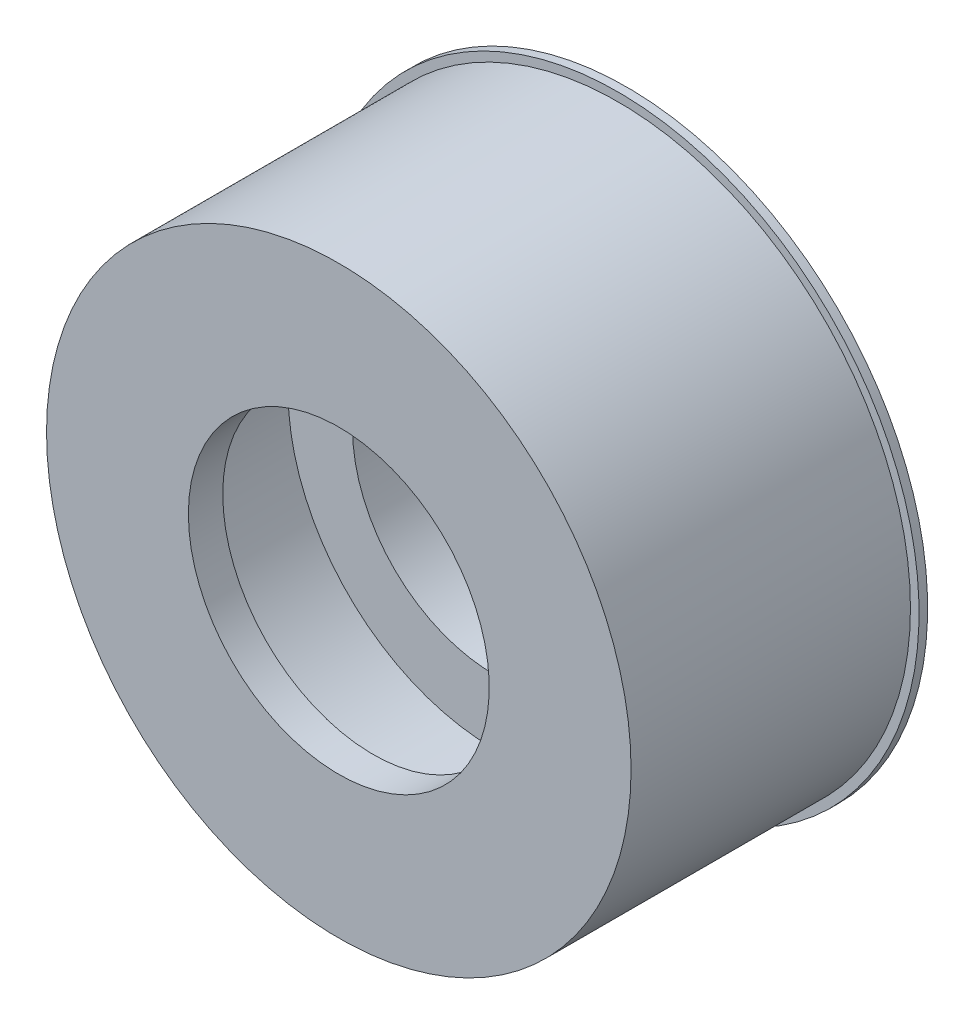
ISO-10303-21;
HEADER;
FILE_DESCRIPTION(('STEP AP214'),'2;1');
FILE_NAME('part.step','',(''),(''),'','','');
FILE_SCHEMA(('AUTOMOTIVE_DESIGN { 1 0 10303 214 1 1 1 1 }'));
ENDSEC;
DATA;
#1=APPLICATION_CONTEXT('core data for automotive mechanical design processes');
#2=APPLICATION_PROTOCOL_DEFINITION('international standard','automotive_design',2000,#1);
#3=PRODUCT_CONTEXT('',#1,'mechanical');
#4=PRODUCT('Part','Part','',(#3));
#5=PRODUCT_RELATED_PRODUCT_CATEGORY('part','',(#4));
#6=PRODUCT_DEFINITION_FORMATION('','',#4);
#7=PRODUCT_DEFINITION_CONTEXT('part definition',#1,'design');
#8=PRODUCT_DEFINITION('design','',#6,#7);
#9=PRODUCT_DEFINITION_SHAPE('','',#8);
#10=(LENGTH_UNIT() NAMED_UNIT(*) SI_UNIT(.MILLI.,.METRE.));
#11=(NAMED_UNIT(*) PLANE_ANGLE_UNIT() SI_UNIT($,.RADIAN.));
#12=(NAMED_UNIT(*) SI_UNIT($,.STERADIAN.) SOLID_ANGLE_UNIT());
#13=UNCERTAINTY_MEASURE_WITH_UNIT(LENGTH_MEASURE(1.E-05),#10,'distance_accuracy_value','');
#14=(GEOMETRIC_REPRESENTATION_CONTEXT(3) GLOBAL_UNCERTAINTY_ASSIGNED_CONTEXT((#13)) GLOBAL_UNIT_ASSIGNED_CONTEXT((#10,
#11,#12)) REPRESENTATION_CONTEXT('',''));
#15=CARTESIAN_POINT('',(0.,0.,0.));
#16=DIRECTION('',(0.,0.,1.));
#17=DIRECTION('',(1.,0.,0.));
#18=AXIS2_PLACEMENT_3D('',#15,#16,#17);
#19=CARTESIAN_POINT('',(-3.5,0.,6.7));
#20=DIRECTION('',(0.,0.,1.));
#21=DIRECTION('',(1.,0.,0.));
#22=AXIS2_PLACEMENT_3D('',#19,#20,#21);
#23=PLANE('',#22);
#24=CARTESIAN_POINT('',(0.,0.,6.7));
#25=DIRECTION('',(0.,0.,-1.));
#26=DIRECTION('',(-1.,0.,0.));
#27=AXIS2_PLACEMENT_3D('',#24,#25,#26);
#28=CIRCLE('',#27,3.5);
#29=CARTESIAN_POINT('',(-3.5,0.,6.7));
#30=VERTEX_POINT('',#29);
#31=EDGE_CURVE('E100',#30,#30,#28,.T.);
#32=ORIENTED_EDGE('',*,*,#31,.T.);
#33=EDGE_LOOP('',(#32));
#34=FACE_BOUND('',#33,.T.);
#35=CARTESIAN_POINT('',(0.,0.,6.7));
#36=DIRECTION('',(0.,0.,-1.));
#37=DIRECTION('',(-1.,0.,0.));
#38=AXIS2_PLACEMENT_3D('',#35,#36,#37);
#39=CIRCLE('',#38,6.8);
#40=CARTESIAN_POINT('',(-6.8,0.,6.7));
#41=VERTEX_POINT('',#40);
#42=EDGE_CURVE('E10',#41,#41,#39,.T.);
#43=ORIENTED_EDGE('',*,*,#42,.F.);
#44=EDGE_LOOP('',(#43));
#45=FACE_BOUND('',#44,.T.);
#46=ADVANCED_FACE('F41',(#34,#45),#23,.T.);
#47=CARTESIAN_POINT('',(0.,0.,0.));
#48=DIRECTION('',(0.,0.,-1.));
#49=DIRECTION('',(-1.,0.,0.));
#50=AXIS2_PLACEMENT_3D('',#47,#48,#49);
#51=CYLINDRICAL_SURFACE('',#50,6.8);
#52=ORIENTED_EDGE('',*,*,#42,.T.);
#53=EDGE_LOOP('',(#52));
#54=FACE_BOUND('',#53,.T.);
#55=CARTESIAN_POINT('',(0.,0.,0.199999999999999));
#56=DIRECTION('',(0.,0.,-1.));
#57=DIRECTION('',(-1.,0.,0.));
#58=AXIS2_PLACEMENT_3D('',#55,#56,#57);
#59=CIRCLE('',#58,6.8);
#60=CARTESIAN_POINT('',(-6.8,0.,0.2));
#61=VERTEX_POINT('',#60);
#62=EDGE_CURVE('E48',#61,#61,#59,.T.);
#63=ORIENTED_EDGE('',*,*,#62,.F.);
#64=EDGE_LOOP('',(#63));
#65=FACE_BOUND('',#64,.T.);
#66=ADVANCED_FACE('F119',(#54,#65),#51,.T.);
#67=CARTESIAN_POINT('',(-7.,0.,0.2));
#68=DIRECTION('',(0.,0.,1.));
#69=DIRECTION('',(1.,0.,0.));
#70=AXIS2_PLACEMENT_3D('',#67,#68,#69);
#71=PLANE('',#70);
#72=ORIENTED_EDGE('',*,*,#62,.T.);
#73=EDGE_LOOP('',(#72));
#74=FACE_BOUND('',#73,.T.);
#75=CARTESIAN_POINT('',(0.,0.,0.199999999999999));
#76=DIRECTION('',(0.,0.,-1.));
#77=DIRECTION('',(-1.,0.,0.));
#78=AXIS2_PLACEMENT_3D('',#75,#76,#77);
#79=CIRCLE('',#78,7.);
#80=CARTESIAN_POINT('',(-7.,0.,0.2));
#81=VERTEX_POINT('',#80);
#82=EDGE_CURVE('E53',#81,#81,#79,.T.);
#83=ORIENTED_EDGE('',*,*,#82,.F.);
#84=EDGE_LOOP('',(#83));
#85=FACE_BOUND('',#84,.T.);
#86=ADVANCED_FACE('F123',(#74,#85),#71,.T.);
#87=CARTESIAN_POINT('',(0.,0.,0.));
#88=DIRECTION('',(0.,0.,-1.));
#89=DIRECTION('',(-1.,0.,0.));
#90=AXIS2_PLACEMENT_3D('',#87,#88,#89);
#91=CYLINDRICAL_SURFACE('',#90,7.);
#92=ORIENTED_EDGE('',*,*,#82,.T.);
#93=EDGE_LOOP('',(#92));
#94=FACE_BOUND('',#93,.T.);
#95=CARTESIAN_POINT('',(0.,0.,0.));
#96=DIRECTION('',(0.,0.,-1.));
#97=DIRECTION('',(-1.,0.,0.));
#98=AXIS2_PLACEMENT_3D('',#95,#96,#97);
#99=CIRCLE('',#98,7.);
#100=CARTESIAN_POINT('',(-7.,0.,0.));
#101=VERTEX_POINT('',#100);
#102=EDGE_CURVE('E58',#101,#101,#99,.T.);
#103=ORIENTED_EDGE('',*,*,#102,.F.);
#104=EDGE_LOOP('',(#103));
#105=FACE_BOUND('',#104,.T.);
#106=ADVANCED_FACE('F127',(#94,#105),#91,.T.);
#107=CARTESIAN_POINT('',(-5.3,0.,0.));
#108=DIRECTION('',(0.,0.,-1.));
#109=DIRECTION('',(-1.,0.,0.));
#110=AXIS2_PLACEMENT_3D('',#107,#108,#109);
#111=PLANE('',#110);
#112=ORIENTED_EDGE('',*,*,#102,.T.);
#113=EDGE_LOOP('',(#112));
#114=FACE_BOUND('',#113,.T.);
#115=CARTESIAN_POINT('',(0.,0.,0.));
#116=DIRECTION('',(0.,0.,-1.));
#117=DIRECTION('',(-1.,0.,0.));
#118=AXIS2_PLACEMENT_3D('',#115,#116,#117);
#119=CIRCLE('',#118,5.3);
#120=CARTESIAN_POINT('',(-5.3,0.,0.));
#121=VERTEX_POINT('',#120);
#122=EDGE_CURVE('E64',#121,#121,#119,.T.);
#123=ORIENTED_EDGE('',*,*,#122,.F.);
#124=EDGE_LOOP('',(#123));
#125=FACE_BOUND('',#124,.T.);
#126=ADVANCED_FACE('F133',(#114,#125),#111,.T.);
#127=CARTESIAN_POINT('',(0.,0.,0.));
#128=DIRECTION('',(0.,0.,-1.));
#129=DIRECTION('',(-1.,0.,0.));
#130=AXIS2_PLACEMENT_3D('',#127,#128,#129);
#131=CYLINDRICAL_SURFACE('',#130,5.3);
#132=ORIENTED_EDGE('',*,*,#122,.T.);
#133=EDGE_LOOP('',(#132));
#134=FACE_BOUND('',#133,.T.);
#135=CARTESIAN_POINT('',(0.,0.,0.399999999999999));
#136=DIRECTION('',(0.,0.,-1.));
#137=DIRECTION('',(-1.,0.,0.));
#138=AXIS2_PLACEMENT_3D('',#135,#136,#137);
#139=CIRCLE('',#138,5.3);
#140=CARTESIAN_POINT('',(-5.3,0.,0.4));
#141=VERTEX_POINT('',#140);
#142=EDGE_CURVE('E68',#141,#141,#139,.T.);
#143=ORIENTED_EDGE('',*,*,#142,.F.);
#144=EDGE_LOOP('',(#143));
#145=FACE_BOUND('',#144,.T.);
#146=ADVANCED_FACE('F137',(#134,#145),#131,.F.);
#147=CARTESIAN_POINT('',(-5.,0.,0.4));
#148=DIRECTION('',(0.,0.,-1.));
#149=DIRECTION('',(-1.,0.,0.));
#150=AXIS2_PLACEMENT_3D('',#147,#148,#149);
#151=PLANE('',#150);
#152=ORIENTED_EDGE('',*,*,#142,.T.);
#153=EDGE_LOOP('',(#152));
#154=FACE_BOUND('',#153,.T.);
#155=CARTESIAN_POINT('',(0.,0.,0.399999999999999));
#156=DIRECTION('',(0.,0.,-1.));
#157=DIRECTION('',(-1.,0.,0.));
#158=AXIS2_PLACEMENT_3D('',#155,#156,#157);
#159=CIRCLE('',#158,5.);
#160=CARTESIAN_POINT('',(-5.,0.,0.4));
#161=VERTEX_POINT('',#160);
#162=EDGE_CURVE('E72',#161,#161,#159,.T.);
#163=ORIENTED_EDGE('',*,*,#162,.F.);
#164=EDGE_LOOP('',(#163));
#165=FACE_BOUND('',#164,.T.);
#166=ADVANCED_FACE('F141',(#154,#165),#151,.T.);
#167=CARTESIAN_POINT('',(0.,0.,0.));
#168=DIRECTION('',(0.,0.,-1.));
#169=DIRECTION('',(-1.,0.,0.));
#170=AXIS2_PLACEMENT_3D('',#167,#168,#169);
#171=CYLINDRICAL_SURFACE('',#170,5.);
#172=ORIENTED_EDGE('',*,*,#162,.T.);
#173=EDGE_LOOP('',(#172));
#174=FACE_BOUND('',#173,.T.);
#175=CARTESIAN_POINT('',(0.,0.,0.999999999999999));
#176=DIRECTION('',(0.,0.,-1.));
#177=DIRECTION('',(-1.,0.,0.));
#178=AXIS2_PLACEMENT_3D('',#175,#176,#177);
#179=CIRCLE('',#178,5.);
#180=CARTESIAN_POINT('',(-5.,0.,1.));
#181=VERTEX_POINT('',#180);
#182=EDGE_CURVE('E76',#181,#181,#179,.T.);
#183=ORIENTED_EDGE('',*,*,#182,.F.);
#184=EDGE_LOOP('',(#183));
#185=FACE_BOUND('',#184,.T.);
#186=ADVANCED_FACE('F145',(#174,#185),#171,.F.);
#187=CARTESIAN_POINT('',(-3.3,0.,1.));
#188=DIRECTION('',(0.,0.,-1.));
#189=DIRECTION('',(-1.,0.,0.));
#190=AXIS2_PLACEMENT_3D('',#187,#188,#189);
#191=PLANE('',#190);
#192=ORIENTED_EDGE('',*,*,#182,.T.);
#193=EDGE_LOOP('',(#192));
#194=FACE_BOUND('',#193,.T.);
#195=CARTESIAN_POINT('',(0.,0.,0.999999999999999));
#196=DIRECTION('',(0.,0.,-1.));
#197=DIRECTION('',(-1.,0.,0.));
#198=AXIS2_PLACEMENT_3D('',#195,#196,#197);
#199=CIRCLE('',#198,3.3);
#200=CARTESIAN_POINT('',(-3.3,0.,1.));
#201=VERTEX_POINT('',#200);
#202=EDGE_CURVE('E80',#201,#201,#199,.T.);
#203=ORIENTED_EDGE('',*,*,#202,.F.);
#204=EDGE_LOOP('',(#203));
#205=FACE_BOUND('',#204,.T.);
#206=ADVANCED_FACE('F149',(#194,#205),#191,.T.);
#207=CARTESIAN_POINT('',(0.,0.,0.));
#208=DIRECTION('',(0.,0.,-1.));
#209=DIRECTION('',(-1.,0.,0.));
#210=AXIS2_PLACEMENT_3D('',#207,#208,#209);
#211=CYLINDRICAL_SURFACE('',#210,3.3);
#212=ORIENTED_EDGE('',*,*,#202,.T.);
#213=EDGE_LOOP('',(#212));
#214=FACE_BOUND('',#213,.T.);
#215=CARTESIAN_POINT('',(0.,0.,3.08));
#216=DIRECTION('',(0.,0.,-1.));
#217=DIRECTION('',(-1.,0.,0.));
#218=AXIS2_PLACEMENT_3D('',#215,#216,#217);
#219=CIRCLE('',#218,3.3);
#220=CARTESIAN_POINT('',(-3.3,0.,3.08));
#221=VERTEX_POINT('',#220);
#222=EDGE_CURVE('E84',#221,#221,#219,.T.);
#223=ORIENTED_EDGE('',*,*,#222,.F.);
#224=EDGE_LOOP('',(#223));
#225=FACE_BOUND('',#224,.T.);
#226=ADVANCED_FACE('F153',(#214,#225),#211,.F.);
#227=CARTESIAN_POINT('',(-4.8,0.,3.08));
#228=DIRECTION('',(0.,0.,1.));
#229=DIRECTION('',(1.,0.,0.));
#230=AXIS2_PLACEMENT_3D('',#227,#228,#229);
#231=PLANE('',#230);
#232=ORIENTED_EDGE('',*,*,#222,.T.);
#233=EDGE_LOOP('',(#232));
#234=FACE_BOUND('',#233,.T.);
#235=CARTESIAN_POINT('',(0.,0.,3.08));
#236=DIRECTION('',(0.,0.,-1.));
#237=DIRECTION('',(-1.,0.,0.));
#238=AXIS2_PLACEMENT_3D('',#235,#236,#237);
#239=CIRCLE('',#238,4.8);
#240=CARTESIAN_POINT('',(-4.8,0.,3.08));
#241=VERTEX_POINT('',#240);
#242=EDGE_CURVE('E88',#241,#241,#239,.T.);
#243=ORIENTED_EDGE('',*,*,#242,.F.);
#244=EDGE_LOOP('',(#243));
#245=FACE_BOUND('',#244,.T.);
#246=ADVANCED_FACE('F157',(#234,#245),#231,.T.);
#247=CARTESIAN_POINT('',(0.,0.,0.));
#248=DIRECTION('',(0.,0.,-1.));
#249=DIRECTION('',(-1.,0.,0.));
#250=AXIS2_PLACEMENT_3D('',#247,#248,#249);
#251=CYLINDRICAL_SURFACE('',#250,4.8);
#252=ORIENTED_EDGE('',*,*,#242,.T.);
#253=EDGE_LOOP('',(#252));
#254=FACE_BOUND('',#253,.T.);
#255=CARTESIAN_POINT('',(0.,0.,5.58));
#256=DIRECTION('',(0.,0.,-1.));
#257=DIRECTION('',(-1.,0.,0.));
#258=AXIS2_PLACEMENT_3D('',#255,#256,#257);
#259=CIRCLE('',#258,4.8);
#260=CARTESIAN_POINT('',(-4.8,0.,5.58));
#261=VERTEX_POINT('',#260);
#262=EDGE_CURVE('E92',#261,#261,#259,.T.);
#263=ORIENTED_EDGE('',*,*,#262,.F.);
#264=EDGE_LOOP('',(#263));
#265=FACE_BOUND('',#264,.T.);
#266=ADVANCED_FACE('F115',(#254,#265),#251,.F.);
#267=CARTESIAN_POINT('',(0.,0.,5.9));
#268=DIRECTION('',(0.,0.,-1.));
#269=DIRECTION('',(-1.,0.,0.));
#270=AXIS2_PLACEMENT_3D('',#267,#268,#269);
#271=CONICAL_SURFACE('',#270,3.5,1.32944083621949);
#272=ORIENTED_EDGE('',*,*,#262,.T.);
#273=EDGE_LOOP('',(#272));
#274=FACE_BOUND('',#273,.T.);
#275=CARTESIAN_POINT('',(0.,0.,5.9));
#276=DIRECTION('',(0.,0.,-1.));
#277=DIRECTION('',(-1.,0.,0.));
#278=AXIS2_PLACEMENT_3D('',#275,#276,#277);
#279=CIRCLE('',#278,3.5);
#280=CARTESIAN_POINT('',(-3.5,0.,5.9));
#281=VERTEX_POINT('',#280);
#282=EDGE_CURVE('E96',#281,#281,#279,.T.);
#283=ORIENTED_EDGE('',*,*,#282,.F.);
#284=EDGE_LOOP('',(#283));
#285=FACE_BOUND('',#284,.T.);
#286=ADVANCED_FACE('F109',(#274,#285),#271,.F.);
#287=CARTESIAN_POINT('',(0.,0.,0.));
#288=DIRECTION('',(0.,0.,-1.));
#289=DIRECTION('',(-1.,0.,0.));
#290=AXIS2_PLACEMENT_3D('',#287,#288,#289);
#291=CYLINDRICAL_SURFACE('',#290,3.5);
#292=ORIENTED_EDGE('',*,*,#282,.T.);
#293=EDGE_LOOP('',(#292));
#294=FACE_BOUND('',#293,.T.);
#295=ORIENTED_EDGE('',*,*,#31,.F.);
#296=EDGE_LOOP('',(#295));
#297=FACE_BOUND('',#296,.T.);
#298=ADVANCED_FACE('F107',(#294,#297),#291,.F.);
#299=CLOSED_SHELL('',(#46,#66,#86,#106,#126,#146,#166,#186,#206,#226,#246,#266,#286,#298));
#300=MANIFOLD_SOLID_BREP('B2',#299);
#301=ADVANCED_BREP_SHAPE_REPRESENTATION('',(#18,#300),#14);
#302=SHAPE_DEFINITION_REPRESENTATION(#9,#301);
ENDSEC;
END-ISO-10303-21;
